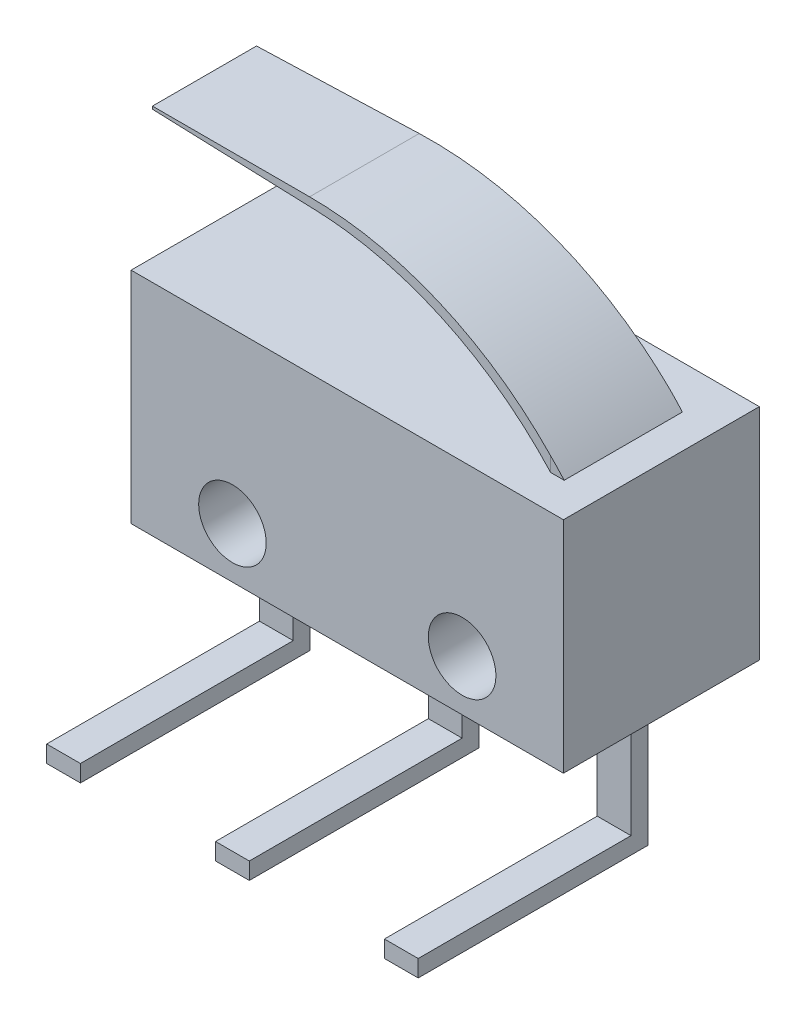
ISO-10303-21;
HEADER;
FILE_DESCRIPTION(('STEP AP214'),'2;1');
FILE_NAME('part.step','',(''),(''),'','','');
FILE_SCHEMA(('AUTOMOTIVE_DESIGN { 1 0 10303 214 1 1 1 1 }'));
ENDSEC;
DATA;
#1=APPLICATION_CONTEXT('core data for automotive mechanical design processes');
#2=APPLICATION_PROTOCOL_DEFINITION('international standard','automotive_design',2000,#1);
#3=PRODUCT_CONTEXT('',#1,'mechanical');
#4=PRODUCT('Part','Part','',(#3));
#5=PRODUCT_RELATED_PRODUCT_CATEGORY('part','',(#4));
#6=PRODUCT_DEFINITION_FORMATION('','',#4);
#7=PRODUCT_DEFINITION_CONTEXT('part definition',#1,'design');
#8=PRODUCT_DEFINITION('design','',#6,#7);
#9=PRODUCT_DEFINITION_SHAPE('','',#8);
#10=(LENGTH_UNIT() NAMED_UNIT(*) SI_UNIT(.MILLI.,.METRE.));
#11=(NAMED_UNIT(*) PLANE_ANGLE_UNIT() SI_UNIT($,.RADIAN.));
#12=(NAMED_UNIT(*) SI_UNIT($,.STERADIAN.) SOLID_ANGLE_UNIT());
#13=UNCERTAINTY_MEASURE_WITH_UNIT(LENGTH_MEASURE(1.E-05),#10,'distance_accuracy_value','');
#14=(GEOMETRIC_REPRESENTATION_CONTEXT(3) GLOBAL_UNCERTAINTY_ASSIGNED_CONTEXT((#13)) GLOBAL_UNIT_ASSIGNED_CONTEXT((#10,
#11,#12)) REPRESENTATION_CONTEXT('',''));
#15=CARTESIAN_POINT('',(0.,0.,0.));
#16=DIRECTION('',(0.,0.,1.));
#17=DIRECTION('',(1.,0.,0.));
#18=AXIS2_PLACEMENT_3D('',#15,#16,#17);
#19=CARTESIAN_POINT('',(0.,6.5,5.8));
#20=DIRECTION('',(0.,-1.,0.));
#21=DIRECTION('',(0.,0.,-1.));
#22=AXIS2_PLACEMENT_3D('',#19,#20,#21);
#23=PLANE('',#22);
#24=DIRECTION('',(-1.,0.,0.));
#25=VECTOR('',#24,1.);
#26=CARTESIAN_POINT('',(0.,6.5,0.));
#27=LINE('',#26,#25);
#28=CARTESIAN_POINT('',(12.8,6.5,0.));
#29=VERTEX_POINT('',#28);
#30=CARTESIAN_POINT('',(0.,6.5,0.));
#31=VERTEX_POINT('',#30);
#32=EDGE_CURVE('E426',#29,#31,#27,.T.);
#33=ORIENTED_EDGE('',*,*,#32,.T.);
#34=DIRECTION('',(0.,0.,-1.));
#35=VECTOR('',#34,1.);
#36=CARTESIAN_POINT('',(0.,6.5,5.8));
#37=LINE('',#36,#35);
#38=CARTESIAN_POINT('',(0.,6.5,5.8));
#39=VERTEX_POINT('',#38);
#40=EDGE_CURVE('E432',#39,#31,#37,.T.);
#41=ORIENTED_EDGE('',*,*,#40,.F.);
#42=DIRECTION('',(-1.,0.,0.));
#43=VECTOR('',#42,1.);
#44=CARTESIAN_POINT('',(0.,6.5,5.8));
#45=LINE('',#44,#43);
#46=CARTESIAN_POINT('',(12.8,6.5,5.8));
#47=VERTEX_POINT('',#46);
#48=EDGE_CURVE('E430',#47,#39,#45,.T.);
#49=ORIENTED_EDGE('',*,*,#48,.F.);
#50=DIRECTION('',(0.,0.,-1.));
#51=VECTOR('',#50,1.);
#52=CARTESIAN_POINT('',(12.8,6.5,5.8));
#53=LINE('',#52,#51);
#54=EDGE_CURVE('E442',#47,#29,#53,.T.);
#55=ORIENTED_EDGE('',*,*,#54,.T.);
#56=EDGE_LOOP('',(#33,#41,#49,#55));
#57=FACE_BOUND('',#56,.T.);
#58=DIRECTION('',(0.,0.,-1.));
#59=VECTOR('',#58,1.);
#60=CARTESIAN_POINT('',(11.8,6.5,1.27790758668561));
#61=LINE('',#60,#59);
#62=CARTESIAN_POINT('',(11.8,6.5,4.77790758668561));
#63=VERTEX_POINT('',#62);
#64=CARTESIAN_POINT('',(11.8,6.5,1.27790758668562));
#65=VERTEX_POINT('',#64);
#66=EDGE_CURVE('E246',#63,#65,#61,.T.);
#67=ORIENTED_EDGE('',*,*,#66,.F.);
#68=DIRECTION('',(1.,0.,0.));
#69=VECTOR('',#68,1.);
#70=CARTESIAN_POINT('',(11.8,6.5,4.77790758668561));
#71=LINE('',#70,#69);
#72=CARTESIAN_POINT('',(11.4,6.5,4.77790758668561));
#73=VERTEX_POINT('',#72);
#74=EDGE_CURVE('E265',#73,#63,#71,.T.);
#75=ORIENTED_EDGE('',*,*,#74,.F.);
#76=DIRECTION('',(0.,0.,1.));
#77=VECTOR('',#76,1.);
#78=CARTESIAN_POINT('',(11.4,6.5,1.27790758668561));
#79=LINE('',#78,#77);
#80=CARTESIAN_POINT('',(11.4,6.5,1.27790758668561));
#81=VERTEX_POINT('',#80);
#82=EDGE_CURVE('E262',#81,#73,#79,.T.);
#83=ORIENTED_EDGE('',*,*,#82,.F.);
#84=DIRECTION('',(-1.,0.,0.));
#85=VECTOR('',#84,1.);
#86=CARTESIAN_POINT('',(11.8,6.5,1.27790758668561));
#87=LINE('',#86,#85);
#88=EDGE_CURVE('E249',#65,#81,#87,.T.);
#89=ORIENTED_EDGE('',*,*,#88,.F.);
#90=EDGE_LOOP('',(#67,#75,#83,#89));
#91=FACE_BOUND('',#90,.T.);
#92=ADVANCED_FACE('F33',(#57,#91),#23,.F.);
#93=CARTESIAN_POINT('',(10.9,-4.,2.9));
#94=DIRECTION('',(0.,0.,-1.));
#95=DIRECTION('',(-1.,0.,0.));
#96=AXIS2_PLACEMENT_3D('',#93,#94,#95);
#97=PLANE('',#96);
#98=DIRECTION('',(-1.,0.,0.));
#99=VECTOR('',#98,1.);
#100=CARTESIAN_POINT('',(10.9,-3.5,2.9));
#101=LINE('',#100,#99);
#102=CARTESIAN_POINT('',(11.9,-3.5,2.9));
#103=VERTEX_POINT('',#102);
#104=CARTESIAN_POINT('',(10.9,-3.5,2.9));
#105=VERTEX_POINT('',#104);
#106=EDGE_CURVE('E283',#103,#105,#101,.T.);
#107=ORIENTED_EDGE('',*,*,#106,.F.);
#108=DIRECTION('',(0.,1.,0.));
#109=VECTOR('',#108,1.);
#110=CARTESIAN_POINT('',(11.9,-4.,2.9));
#111=LINE('',#110,#109);
#112=CARTESIAN_POINT('',(11.9,0.,2.9));
#113=VERTEX_POINT('',#112);
#114=EDGE_CURVE('E355',#103,#113,#111,.T.);
#115=ORIENTED_EDGE('',*,*,#114,.T.);
#116=DIRECTION('',(-1.,0.,0.));
#117=VECTOR('',#116,1.);
#118=CARTESIAN_POINT('',(10.9,0.,2.9));
#119=LINE('',#118,#117);
#120=CARTESIAN_POINT('',(10.9,0.,2.9));
#121=VERTEX_POINT('',#120);
#122=EDGE_CURVE('E339',#113,#121,#119,.T.);
#123=ORIENTED_EDGE('',*,*,#122,.T.);
#124=DIRECTION('',(0.,1.,0.));
#125=VECTOR('',#124,1.);
#126=CARTESIAN_POINT('',(10.9,-4.,2.9));
#127=LINE('',#126,#125);
#128=EDGE_CURVE('E343',#105,#121,#127,.T.);
#129=ORIENTED_EDGE('',*,*,#128,.F.);
#130=EDGE_LOOP('',(#107,#115,#123,#129));
#131=FACE_BOUND('',#130,.T.);
#132=ADVANCED_FACE('F488',(#131),#97,.F.);
#133=CARTESIAN_POINT('',(5.9,-4.,2.9));
#134=DIRECTION('',(0.,0.,-1.));
#135=DIRECTION('',(-1.,0.,0.));
#136=AXIS2_PLACEMENT_3D('',#133,#134,#135);
#137=PLANE('',#136);
#138=DIRECTION('',(-1.,0.,0.));
#139=VECTOR('',#138,1.);
#140=CARTESIAN_POINT('',(5.9,-3.5,2.9));
#141=LINE('',#140,#139);
#142=CARTESIAN_POINT('',(6.9,-3.5,2.9));
#143=VERTEX_POINT('',#142);
#144=CARTESIAN_POINT('',(5.9,-3.5,2.9));
#145=VERTEX_POINT('',#144);
#146=EDGE_CURVE('E300',#143,#145,#141,.T.);
#147=ORIENTED_EDGE('',*,*,#146,.F.);
#148=DIRECTION('',(0.,1.,0.));
#149=VECTOR('',#148,1.);
#150=CARTESIAN_POINT('',(6.9,-4.,2.9));
#151=LINE('',#150,#149);
#152=CARTESIAN_POINT('',(6.9,0.,2.9));
#153=VERTEX_POINT('',#152);
#154=EDGE_CURVE('E384',#143,#153,#151,.T.);
#155=ORIENTED_EDGE('',*,*,#154,.T.);
#156=DIRECTION('',(-1.,0.,0.));
#157=VECTOR('',#156,1.);
#158=CARTESIAN_POINT('',(5.9,0.,2.9));
#159=LINE('',#158,#157);
#160=CARTESIAN_POINT('',(5.9,0.,2.9));
#161=VERTEX_POINT('',#160);
#162=EDGE_CURVE('E368',#153,#161,#159,.T.);
#163=ORIENTED_EDGE('',*,*,#162,.T.);
#164=DIRECTION('',(0.,1.,0.));
#165=VECTOR('',#164,1.);
#166=CARTESIAN_POINT('',(5.9,-4.,2.9));
#167=LINE('',#166,#165);
#168=EDGE_CURVE('E372',#145,#161,#167,.T.);
#169=ORIENTED_EDGE('',*,*,#168,.F.);
#170=EDGE_LOOP('',(#147,#155,#163,#169));
#171=FACE_BOUND('',#170,.T.);
#172=ADVANCED_FACE('F494',(#171),#137,.F.);
#173=CARTESIAN_POINT('',(0.9,-4.,2.9));
#174=DIRECTION('',(0.,0.,-1.));
#175=DIRECTION('',(-1.,0.,0.));
#176=AXIS2_PLACEMENT_3D('',#173,#174,#175);
#177=PLANE('',#176);
#178=DIRECTION('',(-1.,0.,0.));
#179=VECTOR('',#178,1.);
#180=CARTESIAN_POINT('',(0.9,-3.5,2.9));
#181=LINE('',#180,#179);
#182=CARTESIAN_POINT('',(1.9,-3.5,2.9));
#183=VERTEX_POINT('',#182);
#184=CARTESIAN_POINT('',(0.9,-3.5,2.9));
#185=VERTEX_POINT('',#184);
#186=EDGE_CURVE('E317',#183,#185,#181,.T.);
#187=ORIENTED_EDGE('',*,*,#186,.F.);
#188=DIRECTION('',(0.,1.,0.));
#189=VECTOR('',#188,1.);
#190=CARTESIAN_POINT('',(1.9,-4.,2.9));
#191=LINE('',#190,#189);
#192=CARTESIAN_POINT('',(1.9,0.,2.9));
#193=VERTEX_POINT('',#192);
#194=EDGE_CURVE('E413',#183,#193,#191,.T.);
#195=ORIENTED_EDGE('',*,*,#194,.T.);
#196=DIRECTION('',(-1.,0.,0.));
#197=VECTOR('',#196,1.);
#198=CARTESIAN_POINT('',(0.9,0.,2.9));
#199=LINE('',#198,#197);
#200=CARTESIAN_POINT('',(0.9,0.,2.9));
#201=VERTEX_POINT('',#200);
#202=EDGE_CURVE('E397',#193,#201,#199,.T.);
#203=ORIENTED_EDGE('',*,*,#202,.T.);
#204=DIRECTION('',(0.,1.,0.));
#205=VECTOR('',#204,1.);
#206=CARTESIAN_POINT('',(0.9,-4.,2.9));
#207=LINE('',#206,#205);
#208=EDGE_CURVE('E401',#185,#201,#207,.T.);
#209=ORIENTED_EDGE('',*,*,#208,.F.);
#210=EDGE_LOOP('',(#187,#195,#203,#209));
#211=FACE_BOUND('',#210,.T.);
#212=ADVANCED_FACE('F510',(#211),#177,.F.);
#213=CARTESIAN_POINT('',(0.,0.,5.8));
#214=DIRECTION('',(0.,1.,0.));
#215=DIRECTION('',(0.,0.,1.));
#216=AXIS2_PLACEMENT_3D('',#213,#214,#215);
#217=PLANE('',#216);
#218=DIRECTION('',(0.,0.,-1.));
#219=VECTOR('',#218,1.);
#220=CARTESIAN_POINT('',(5.9,0.,2.9));
#221=LINE('',#220,#219);
#222=CARTESIAN_POINT('',(5.9,0.,2.4));
#223=VERTEX_POINT('',#222);
#224=EDGE_CURVE('E363',#161,#223,#221,.T.);
#225=ORIENTED_EDGE('',*,*,#224,.F.);
#226=ORIENTED_EDGE('',*,*,#162,.F.);
#227=DIRECTION('',(0.,0.,1.));
#228=VECTOR('',#227,1.);
#229=CARTESIAN_POINT('',(6.9,0.,2.9));
#230=LINE('',#229,#228);
#231=CARTESIAN_POINT('',(6.9,0.,2.4));
#232=VERTEX_POINT('',#231);
#233=EDGE_CURVE('E378',#232,#153,#230,.T.);
#234=ORIENTED_EDGE('',*,*,#233,.F.);
#235=DIRECTION('',(1.,0.,0.));
#236=VECTOR('',#235,1.);
#237=CARTESIAN_POINT('',(5.9,0.,2.4));
#238=LINE('',#237,#236);
#239=EDGE_CURVE('E375',#223,#232,#238,.T.);
#240=ORIENTED_EDGE('',*,*,#239,.F.);
#241=EDGE_LOOP('',(#225,#226,#234,#240));
#242=FACE_BOUND('',#241,.T.);
#243=DIRECTION('',(1.,0.,0.));
#244=VECTOR('',#243,1.);
#245=CARTESIAN_POINT('',(0.,0.,0.));
#246=LINE('',#245,#244);
#247=CARTESIAN_POINT('',(0.,0.,0.));
#248=VERTEX_POINT('',#247);
#249=CARTESIAN_POINT('',(12.8,0.,0.));
#250=VERTEX_POINT('',#249);
#251=EDGE_CURVE('E435',#248,#250,#246,.T.);
#252=ORIENTED_EDGE('',*,*,#251,.T.);
#253=DIRECTION('',(0.,0.,-1.));
#254=VECTOR('',#253,1.);
#255=CARTESIAN_POINT('',(12.8,0.,5.8));
#256=LINE('',#255,#254);
#257=CARTESIAN_POINT('',(12.8,0.,5.8));
#258=VERTEX_POINT('',#257);
#259=EDGE_CURVE('E445',#258,#250,#256,.T.);
#260=ORIENTED_EDGE('',*,*,#259,.F.);
#261=DIRECTION('',(1.,0.,0.));
#262=VECTOR('',#261,1.);
#263=CARTESIAN_POINT('',(0.,0.,5.8));
#264=LINE('',#263,#262);
#265=CARTESIAN_POINT('',(0.,0.,5.8));
#266=VERTEX_POINT('',#265);
#267=EDGE_CURVE('E425',#266,#258,#264,.T.);
#268=ORIENTED_EDGE('',*,*,#267,.F.);
#269=DIRECTION('',(0.,0.,-1.));
#270=VECTOR('',#269,1.);
#271=CARTESIAN_POINT('',(0.,0.,5.8));
#272=LINE('',#271,#270);
#273=EDGE_CURVE('E448',#266,#248,#272,.T.);
#274=ORIENTED_EDGE('',*,*,#273,.T.);
#275=EDGE_LOOP('',(#252,#260,#268,#274));
#276=FACE_BOUND('',#275,.T.);
#277=DIRECTION('',(0.,0.,-1.));
#278=VECTOR('',#277,1.);
#279=CARTESIAN_POINT('',(0.9,0.,2.9));
#280=LINE('',#279,#278);
#281=CARTESIAN_POINT('',(0.9,0.,2.4));
#282=VERTEX_POINT('',#281);
#283=EDGE_CURVE('E392',#201,#282,#280,.T.);
#284=ORIENTED_EDGE('',*,*,#283,.F.);
#285=ORIENTED_EDGE('',*,*,#202,.F.);
#286=DIRECTION('',(0.,0.,1.));
#287=VECTOR('',#286,1.);
#288=CARTESIAN_POINT('',(1.9,0.,2.9));
#289=LINE('',#288,#287);
#290=CARTESIAN_POINT('',(1.9,0.,2.4));
#291=VERTEX_POINT('',#290);
#292=EDGE_CURVE('E407',#291,#193,#289,.T.);
#293=ORIENTED_EDGE('',*,*,#292,.F.);
#294=DIRECTION('',(1.,0.,0.));
#295=VECTOR('',#294,1.);
#296=CARTESIAN_POINT('',(0.9,0.,2.4));
#297=LINE('',#296,#295);
#298=EDGE_CURVE('E404',#282,#291,#297,.T.);
#299=ORIENTED_EDGE('',*,*,#298,.F.);
#300=EDGE_LOOP('',(#284,#285,#293,#299));
#301=FACE_BOUND('',#300,.T.);
#302=DIRECTION('',(0.,0.,-1.));
#303=VECTOR('',#302,1.);
#304=CARTESIAN_POINT('',(10.9,0.,2.9));
#305=LINE('',#304,#303);
#306=CARTESIAN_POINT('',(10.9,0.,2.4));
#307=VERTEX_POINT('',#306);
#308=EDGE_CURVE('E334',#121,#307,#305,.T.);
#309=ORIENTED_EDGE('',*,*,#308,.F.);
#310=ORIENTED_EDGE('',*,*,#122,.F.);
#311=DIRECTION('',(0.,0.,1.));
#312=VECTOR('',#311,1.);
#313=CARTESIAN_POINT('',(11.9,0.,2.9));
#314=LINE('',#313,#312);
#315=CARTESIAN_POINT('',(11.9,0.,2.4));
#316=VERTEX_POINT('',#315);
#317=EDGE_CURVE('E349',#316,#113,#314,.T.);
#318=ORIENTED_EDGE('',*,*,#317,.F.);
#319=DIRECTION('',(1.,0.,0.));
#320=VECTOR('',#319,1.);
#321=CARTESIAN_POINT('',(10.9,0.,2.4));
#322=LINE('',#321,#320);
#323=EDGE_CURVE('E346',#307,#316,#322,.T.);
#324=ORIENTED_EDGE('',*,*,#323,.F.);
#325=EDGE_LOOP('',(#309,#310,#318,#324));
#326=FACE_BOUND('',#325,.T.);
#327=ADVANCED_FACE('F507',(#242,#276,#301,#326),#217,.F.);
#328=CARTESIAN_POINT('',(0.,0.,5.8));
#329=DIRECTION('',(1.,0.,0.));
#330=DIRECTION('',(0.,0.,-1.));
#331=AXIS2_PLACEMENT_3D('',#328,#329,#330);
#332=PLANE('',#331);
#333=DIRECTION('',(0.,-1.,0.));
#334=VECTOR('',#333,1.);
#335=CARTESIAN_POINT('',(0.,0.,0.));
#336=LINE('',#335,#334);
#337=EDGE_CURVE('E421',#31,#248,#336,.T.);
#338=ORIENTED_EDGE('',*,*,#337,.T.);
#339=ORIENTED_EDGE('',*,*,#273,.F.);
#340=DIRECTION('',(0.,-1.,0.));
#341=VECTOR('',#340,1.);
#342=CARTESIAN_POINT('',(0.,0.,5.8));
#343=LINE('',#342,#341);
#344=EDGE_CURVE('E422',#39,#266,#343,.T.);
#345=ORIENTED_EDGE('',*,*,#344,.F.);
#346=ORIENTED_EDGE('',*,*,#40,.T.);
#347=EDGE_LOOP('',(#338,#339,#345,#346));
#348=FACE_BOUND('',#347,.T.);
#349=ADVANCED_FACE('F505',(#348),#332,.F.);
#350=CARTESIAN_POINT('',(12.8,0.,5.8));
#351=DIRECTION('',(-1.,0.,0.));
#352=DIRECTION('',(0.,0.,1.));
#353=AXIS2_PLACEMENT_3D('',#350,#351,#352);
#354=PLANE('',#353);
#355=DIRECTION('',(0.,1.,0.));
#356=VECTOR('',#355,1.);
#357=CARTESIAN_POINT('',(12.8,0.,0.));
#358=LINE('',#357,#356);
#359=EDGE_CURVE('E437',#250,#29,#358,.T.);
#360=ORIENTED_EDGE('',*,*,#359,.T.);
#361=ORIENTED_EDGE('',*,*,#54,.F.);
#362=DIRECTION('',(0.,1.,0.));
#363=VECTOR('',#362,1.);
#364=CARTESIAN_POINT('',(12.8,0.,5.8));
#365=LINE('',#364,#363);
#366=EDGE_CURVE('E428',#258,#47,#365,.T.);
#367=ORIENTED_EDGE('',*,*,#366,.F.);
#368=ORIENTED_EDGE('',*,*,#259,.T.);
#369=EDGE_LOOP('',(#360,#361,#367,#368));
#370=FACE_BOUND('',#369,.T.);
#371=ADVANCED_FACE('F501',(#370),#354,.F.);
#372=CARTESIAN_POINT('',(0.,0.,5.8));
#373=DIRECTION('',(0.,0.,-1.));
#374=DIRECTION('',(-1.,0.,0.));
#375=AXIS2_PLACEMENT_3D('',#372,#373,#374);
#376=PLANE('',#375);
#377=CARTESIAN_POINT('',(3.,1.5,5.8));
#378=DIRECTION('',(0.,0.,-1.));
#379=DIRECTION('',(-1.,0.,0.));
#380=AXIS2_PLACEMENT_3D('',#377,#378,#379);
#381=CIRCLE('',#380,1.);
#382=CARTESIAN_POINT('',(2.,1.5,5.8));
#383=VERTEX_POINT('',#382);
#384=EDGE_CURVE('E274',#383,#383,#381,.T.);
#385=ORIENTED_EDGE('',*,*,#384,.T.);
#386=EDGE_LOOP('',(#385));
#387=FACE_BOUND('',#386,.T.);
#388=CARTESIAN_POINT('',(9.8,1.5,5.8));
#389=DIRECTION('',(0.,0.,-1.));
#390=DIRECTION('',(-1.,0.,0.));
#391=AXIS2_PLACEMENT_3D('',#388,#389,#390);
#392=CIRCLE('',#391,1.);
#393=CARTESIAN_POINT('',(8.8,1.5,5.8));
#394=VERTEX_POINT('',#393);
#395=EDGE_CURVE('E280',#394,#394,#392,.T.);
#396=ORIENTED_EDGE('',*,*,#395,.T.);
#397=EDGE_LOOP('',(#396));
#398=FACE_BOUND('',#397,.T.);
#399=ORIENTED_EDGE('',*,*,#344,.T.);
#400=ORIENTED_EDGE('',*,*,#267,.T.);
#401=ORIENTED_EDGE('',*,*,#366,.T.);
#402=ORIENTED_EDGE('',*,*,#48,.T.);
#403=EDGE_LOOP('',(#399,#400,#401,#402));
#404=FACE_BOUND('',#403,.T.);
#405=ADVANCED_FACE('F504',(#387,#398,#404),#376,.F.);
#406=CARTESIAN_POINT('',(0.,0.,0.));
#407=DIRECTION('',(0.,0.,-1.));
#408=DIRECTION('',(-1.,0.,0.));
#409=AXIS2_PLACEMENT_3D('',#406,#407,#408);
#410=PLANE('',#409);
#411=CARTESIAN_POINT('',(3.,1.5,0.));
#412=DIRECTION('',(0.,0.,-1.));
#413=DIRECTION('',(1.,0.,0.));
#414=AXIS2_PLACEMENT_3D('',#411,#412,#413);
#415=CIRCLE('',#414,1.);
#416=CARTESIAN_POINT('',(4.,1.5,0.));
#417=VERTEX_POINT('',#416);
#418=EDGE_CURVE('E271',#417,#417,#415,.T.);
#419=ORIENTED_EDGE('',*,*,#418,.F.);
#420=EDGE_LOOP('',(#419));
#421=FACE_BOUND('',#420,.T.);
#422=CARTESIAN_POINT('',(9.8,1.5,0.));
#423=DIRECTION('',(0.,0.,-1.));
#424=DIRECTION('',(-1.,0.,0.));
#425=AXIS2_PLACEMENT_3D('',#422,#423,#424);
#426=CIRCLE('',#425,1.);
#427=CARTESIAN_POINT('',(8.8,1.5,0.));
#428=VERTEX_POINT('',#427);
#429=EDGE_CURVE('E277',#428,#428,#426,.T.);
#430=ORIENTED_EDGE('',*,*,#429,.F.);
#431=EDGE_LOOP('',(#430));
#432=FACE_BOUND('',#431,.T.);
#433=ORIENTED_EDGE('',*,*,#337,.F.);
#434=ORIENTED_EDGE('',*,*,#32,.F.);
#435=ORIENTED_EDGE('',*,*,#359,.F.);
#436=ORIENTED_EDGE('',*,*,#251,.F.);
#437=EDGE_LOOP('',(#433,#434,#435,#436));
#438=FACE_BOUND('',#437,.T.);
#439=ADVANCED_FACE('F499',(#421,#432,#438),#410,.T.);
#440=CARTESIAN_POINT('',(0.9,-4.,2.9));
#441=DIRECTION('',(1.,0.,0.));
#442=DIRECTION('',(0.,0.,-1.));
#443=AXIS2_PLACEMENT_3D('',#440,#441,#442);
#444=PLANE('',#443);
#445=ORIENTED_EDGE('',*,*,#283,.T.);
#446=DIRECTION('',(0.,1.,0.));
#447=VECTOR('',#446,1.);
#448=CARTESIAN_POINT('',(0.9,-4.,2.4));
#449=LINE('',#448,#447);
#450=CARTESIAN_POINT('',(0.9,-4.,2.4));
#451=VERTEX_POINT('',#450);
#452=EDGE_CURVE('E418',#451,#282,#449,.T.);
#453=ORIENTED_EDGE('',*,*,#452,.F.);
#454=DIRECTION('',(0.,0.,-1.));
#455=VECTOR('',#454,1.);
#456=CARTESIAN_POINT('',(0.9,-4.,2.9));
#457=LINE('',#456,#455);
#458=CARTESIAN_POINT('',(0.9,-4.,9.2));
#459=VERTEX_POINT('',#458);
#460=EDGE_CURVE('E393',#459,#451,#457,.T.);
#461=ORIENTED_EDGE('',*,*,#460,.F.);
#462=DIRECTION('',(0.,-1.,0.));
#463=VECTOR('',#462,1.);
#464=CARTESIAN_POINT('',(0.9,-4.,9.2));
#465=LINE('',#464,#463);
#466=CARTESIAN_POINT('',(0.9,-3.5,9.2));
#467=VERTEX_POINT('',#466);
#468=EDGE_CURVE('E318',#467,#459,#465,.T.);
#469=ORIENTED_EDGE('',*,*,#468,.F.);
#470=DIRECTION('',(0.,0.,-1.));
#471=VECTOR('',#470,1.);
#472=CARTESIAN_POINT('',(0.9,-3.5,9.2));
#473=LINE('',#472,#471);
#474=EDGE_CURVE('E328',#467,#185,#473,.T.);
#475=ORIENTED_EDGE('',*,*,#474,.T.);
#476=ORIENTED_EDGE('',*,*,#208,.T.);
#477=EDGE_LOOP('',(#445,#453,#461,#469,#475,#476));
#478=FACE_BOUND('',#477,.T.);
#479=ADVANCED_FACE('F609',(#478),#444,.F.);
#480=CARTESIAN_POINT('',(0.9,-4.,2.4));
#481=DIRECTION('',(0.,0.,1.));
#482=DIRECTION('',(1.,0.,0.));
#483=AXIS2_PLACEMENT_3D('',#480,#481,#482);
#484=PLANE('',#483);
#485=ORIENTED_EDGE('',*,*,#298,.T.);
#486=DIRECTION('',(0.,1.,0.));
#487=VECTOR('',#486,1.);
#488=CARTESIAN_POINT('',(1.9,-4.,2.4));
#489=LINE('',#488,#487);
#490=CARTESIAN_POINT('',(1.9,-4.,2.4));
#491=VERTEX_POINT('',#490);
#492=EDGE_CURVE('E415',#491,#291,#489,.T.);
#493=ORIENTED_EDGE('',*,*,#492,.F.);
#494=DIRECTION('',(1.,0.,0.));
#495=VECTOR('',#494,1.);
#496=CARTESIAN_POINT('',(0.9,-4.,2.4));
#497=LINE('',#496,#495);
#498=EDGE_CURVE('E396',#451,#491,#497,.T.);
#499=ORIENTED_EDGE('',*,*,#498,.F.);
#500=ORIENTED_EDGE('',*,*,#452,.T.);
#501=EDGE_LOOP('',(#485,#493,#499,#500));
#502=FACE_BOUND('',#501,.T.);
#503=ADVANCED_FACE('F768',(#502),#484,.F.);
#504=CARTESIAN_POINT('',(1.9,-4.,2.9));
#505=DIRECTION('',(-1.,0.,0.));
#506=DIRECTION('',(0.,0.,1.));
#507=AXIS2_PLACEMENT_3D('',#504,#505,#506);
#508=PLANE('',#507);
#509=ORIENTED_EDGE('',*,*,#292,.T.);
#510=ORIENTED_EDGE('',*,*,#194,.F.);
#511=DIRECTION('',(0.,0.,-1.));
#512=VECTOR('',#511,1.);
#513=CARTESIAN_POINT('',(1.9,-3.5,9.2));
#514=LINE('',#513,#512);
#515=CARTESIAN_POINT('',(1.9,-3.5,9.2));
#516=VERTEX_POINT('',#515);
#517=EDGE_CURVE('E332',#516,#183,#514,.T.);
#518=ORIENTED_EDGE('',*,*,#517,.F.);
#519=DIRECTION('',(0.,1.,0.));
#520=VECTOR('',#519,1.);
#521=CARTESIAN_POINT('',(1.9,-4.,9.2));
#522=LINE('',#521,#520);
#523=CARTESIAN_POINT('',(1.9,-4.,9.2));
#524=VERTEX_POINT('',#523);
#525=EDGE_CURVE('E324',#524,#516,#522,.T.);
#526=ORIENTED_EDGE('',*,*,#525,.F.);
#527=DIRECTION('',(0.,0.,1.));
#528=VECTOR('',#527,1.);
#529=CARTESIAN_POINT('',(1.9,-4.,2.9));
#530=LINE('',#529,#528);
#531=EDGE_CURVE('E399',#491,#524,#530,.T.);
#532=ORIENTED_EDGE('',*,*,#531,.F.);
#533=ORIENTED_EDGE('',*,*,#492,.T.);
#534=EDGE_LOOP('',(#509,#510,#518,#526,#532,#533));
#535=FACE_BOUND('',#534,.T.);
#536=ADVANCED_FACE('F757',(#535),#508,.F.);
#537=CARTESIAN_POINT('',(0.,-4.,0.));
#538=DIRECTION('',(0.,-1.,0.));
#539=DIRECTION('',(0.,0.,-1.));
#540=AXIS2_PLACEMENT_3D('',#537,#538,#539);
#541=PLANE('',#540);
#542=ORIENTED_EDGE('',*,*,#460,.T.);
#543=ORIENTED_EDGE('',*,*,#498,.T.);
#544=ORIENTED_EDGE('',*,*,#531,.T.);
#545=DIRECTION('',(1.,0.,0.));
#546=VECTOR('',#545,1.);
#547=CARTESIAN_POINT('',(0.9,-4.,9.2));
#548=LINE('',#547,#546);
#549=EDGE_CURVE('E321',#459,#524,#548,.T.);
#550=ORIENTED_EDGE('',*,*,#549,.F.);
#551=EDGE_LOOP('',(#542,#543,#544,#550));
#552=FACE_BOUND('',#551,.T.);
#553=ADVANCED_FACE('F746',(#552),#541,.T.);
#554=CARTESIAN_POINT('',(5.9,-4.,2.9));
#555=DIRECTION('',(1.,0.,0.));
#556=DIRECTION('',(0.,0.,-1.));
#557=AXIS2_PLACEMENT_3D('',#554,#555,#556);
#558=PLANE('',#557);
#559=ORIENTED_EDGE('',*,*,#224,.T.);
#560=DIRECTION('',(0.,1.,0.));
#561=VECTOR('',#560,1.);
#562=CARTESIAN_POINT('',(5.9,-4.,2.4));
#563=LINE('',#562,#561);
#564=CARTESIAN_POINT('',(5.9,-4.,2.4));
#565=VERTEX_POINT('',#564);
#566=EDGE_CURVE('E389',#565,#223,#563,.T.);
#567=ORIENTED_EDGE('',*,*,#566,.F.);
#568=DIRECTION('',(0.,0.,-1.));
#569=VECTOR('',#568,1.);
#570=CARTESIAN_POINT('',(5.9,-4.,2.9));
#571=LINE('',#570,#569);
#572=CARTESIAN_POINT('',(5.9,-4.,9.2));
#573=VERTEX_POINT('',#572);
#574=EDGE_CURVE('E364',#573,#565,#571,.T.);
#575=ORIENTED_EDGE('',*,*,#574,.F.);
#576=DIRECTION('',(0.,-1.,0.));
#577=VECTOR('',#576,1.);
#578=CARTESIAN_POINT('',(5.9,-4.,9.2));
#579=LINE('',#578,#577);
#580=CARTESIAN_POINT('',(5.9,-3.5,9.2));
#581=VERTEX_POINT('',#580);
#582=EDGE_CURVE('E301',#581,#573,#579,.T.);
#583=ORIENTED_EDGE('',*,*,#582,.F.);
#584=DIRECTION('',(0.,0.,-1.));
#585=VECTOR('',#584,1.);
#586=CARTESIAN_POINT('',(5.9,-3.5,9.2));
#587=LINE('',#586,#585);
#588=EDGE_CURVE('E311',#581,#145,#587,.T.);
#589=ORIENTED_EDGE('',*,*,#588,.T.);
#590=ORIENTED_EDGE('',*,*,#168,.T.);
#591=EDGE_LOOP('',(#559,#567,#575,#583,#589,#590));
#592=FACE_BOUND('',#591,.T.);
#593=ADVANCED_FACE('F742',(#592),#558,.F.);
#594=CARTESIAN_POINT('',(5.9,-4.,2.4));
#595=DIRECTION('',(0.,0.,1.));
#596=DIRECTION('',(1.,0.,0.));
#597=AXIS2_PLACEMENT_3D('',#594,#595,#596);
#598=PLANE('',#597);
#599=ORIENTED_EDGE('',*,*,#239,.T.);
#600=DIRECTION('',(0.,1.,0.));
#601=VECTOR('',#600,1.);
#602=CARTESIAN_POINT('',(6.9,-4.,2.4));
#603=LINE('',#602,#601);
#604=CARTESIAN_POINT('',(6.9,-4.,2.4));
#605=VERTEX_POINT('',#604);
#606=EDGE_CURVE('E386',#605,#232,#603,.T.);
#607=ORIENTED_EDGE('',*,*,#606,.F.);
#608=DIRECTION('',(1.,0.,0.));
#609=VECTOR('',#608,1.);
#610=CARTESIAN_POINT('',(5.9,-4.,2.4));
#611=LINE('',#610,#609);
#612=EDGE_CURVE('E367',#565,#605,#611,.T.);
#613=ORIENTED_EDGE('',*,*,#612,.F.);
#614=ORIENTED_EDGE('',*,*,#566,.T.);
#615=EDGE_LOOP('',(#599,#607,#613,#614));
#616=FACE_BOUND('',#615,.T.);
#617=ADVANCED_FACE('F733',(#616),#598,.F.);
#618=CARTESIAN_POINT('',(6.9,-4.,2.9));
#619=DIRECTION('',(-1.,0.,0.));
#620=DIRECTION('',(0.,0.,1.));
#621=AXIS2_PLACEMENT_3D('',#618,#619,#620);
#622=PLANE('',#621);
#623=ORIENTED_EDGE('',*,*,#233,.T.);
#624=ORIENTED_EDGE('',*,*,#154,.F.);
#625=DIRECTION('',(0.,0.,-1.));
#626=VECTOR('',#625,1.);
#627=CARTESIAN_POINT('',(6.9,-3.5,9.2));
#628=LINE('',#627,#626);
#629=CARTESIAN_POINT('',(6.9,-3.5,9.2));
#630=VERTEX_POINT('',#629);
#631=EDGE_CURVE('E315',#630,#143,#628,.T.);
#632=ORIENTED_EDGE('',*,*,#631,.F.);
#633=DIRECTION('',(0.,1.,0.));
#634=VECTOR('',#633,1.);
#635=CARTESIAN_POINT('',(6.9,-4.,9.2));
#636=LINE('',#635,#634);
#637=CARTESIAN_POINT('',(6.9,-4.,9.2));
#638=VERTEX_POINT('',#637);
#639=EDGE_CURVE('E307',#638,#630,#636,.T.);
#640=ORIENTED_EDGE('',*,*,#639,.F.);
#641=DIRECTION('',(0.,0.,1.));
#642=VECTOR('',#641,1.);
#643=CARTESIAN_POINT('',(6.9,-4.,2.9));
#644=LINE('',#643,#642);
#645=EDGE_CURVE('E370',#605,#638,#644,.T.);
#646=ORIENTED_EDGE('',*,*,#645,.F.);
#647=ORIENTED_EDGE('',*,*,#606,.T.);
#648=EDGE_LOOP('',(#623,#624,#632,#640,#646,#647));
#649=FACE_BOUND('',#648,.T.);
#650=ADVANCED_FACE('F722',(#649),#622,.F.);
#651=CARTESIAN_POINT('',(0.,-4.,0.));
#652=DIRECTION('',(0.,-1.,0.));
#653=DIRECTION('',(0.,0.,-1.));
#654=AXIS2_PLACEMENT_3D('',#651,#652,#653);
#655=PLANE('',#654);
#656=ORIENTED_EDGE('',*,*,#574,.T.);
#657=ORIENTED_EDGE('',*,*,#612,.T.);
#658=ORIENTED_EDGE('',*,*,#645,.T.);
#659=DIRECTION('',(1.,0.,0.));
#660=VECTOR('',#659,1.);
#661=CARTESIAN_POINT('',(5.9,-4.,9.2));
#662=LINE('',#661,#660);
#663=EDGE_CURVE('E304',#573,#638,#662,.T.);
#664=ORIENTED_EDGE('',*,*,#663,.F.);
#665=EDGE_LOOP('',(#656,#657,#658,#664));
#666=FACE_BOUND('',#665,.T.);
#667=ADVANCED_FACE('F711',(#666),#655,.T.);
#668=CARTESIAN_POINT('',(10.9,-4.,2.9));
#669=DIRECTION('',(1.,0.,0.));
#670=DIRECTION('',(0.,0.,-1.));
#671=AXIS2_PLACEMENT_3D('',#668,#669,#670);
#672=PLANE('',#671);
#673=ORIENTED_EDGE('',*,*,#308,.T.);
#674=DIRECTION('',(0.,1.,0.));
#675=VECTOR('',#674,1.);
#676=CARTESIAN_POINT('',(10.9,-4.,2.4));
#677=LINE('',#676,#675);
#678=CARTESIAN_POINT('',(10.9,-4.,2.4));
#679=VERTEX_POINT('',#678);
#680=EDGE_CURVE('E360',#679,#307,#677,.T.);
#681=ORIENTED_EDGE('',*,*,#680,.F.);
#682=DIRECTION('',(0.,0.,-1.));
#683=VECTOR('',#682,1.);
#684=CARTESIAN_POINT('',(10.9,-4.,2.9));
#685=LINE('',#684,#683);
#686=CARTESIAN_POINT('',(10.9,-4.,9.2));
#687=VERTEX_POINT('',#686);
#688=EDGE_CURVE('E335',#687,#679,#685,.T.);
#689=ORIENTED_EDGE('',*,*,#688,.F.);
#690=DIRECTION('',(0.,-1.,0.));
#691=VECTOR('',#690,1.);
#692=CARTESIAN_POINT('',(10.9,-4.,9.2));
#693=LINE('',#692,#691);
#694=CARTESIAN_POINT('',(10.9,-3.5,9.2));
#695=VERTEX_POINT('',#694);
#696=EDGE_CURVE('E284',#695,#687,#693,.T.);
#697=ORIENTED_EDGE('',*,*,#696,.F.);
#698=DIRECTION('',(0.,0.,-1.));
#699=VECTOR('',#698,1.);
#700=CARTESIAN_POINT('',(10.9,-3.5,9.2));
#701=LINE('',#700,#699);
#702=EDGE_CURVE('E294',#695,#105,#701,.T.);
#703=ORIENTED_EDGE('',*,*,#702,.T.);
#704=ORIENTED_EDGE('',*,*,#128,.T.);
#705=EDGE_LOOP('',(#673,#681,#689,#697,#703,#704));
#706=FACE_BOUND('',#705,.T.);
#707=ADVANCED_FACE('F707',(#706),#672,.F.);
#708=CARTESIAN_POINT('',(10.9,-4.,2.4));
#709=DIRECTION('',(0.,0.,1.));
#710=DIRECTION('',(1.,0.,0.));
#711=AXIS2_PLACEMENT_3D('',#708,#709,#710);
#712=PLANE('',#711);
#713=ORIENTED_EDGE('',*,*,#323,.T.);
#714=DIRECTION('',(0.,1.,0.));
#715=VECTOR('',#714,1.);
#716=CARTESIAN_POINT('',(11.9,-4.,2.4));
#717=LINE('',#716,#715);
#718=CARTESIAN_POINT('',(11.9,-4.,2.4));
#719=VERTEX_POINT('',#718);
#720=EDGE_CURVE('E357',#719,#316,#717,.T.);
#721=ORIENTED_EDGE('',*,*,#720,.F.);
#722=DIRECTION('',(1.,0.,0.));
#723=VECTOR('',#722,1.);
#724=CARTESIAN_POINT('',(10.9,-4.,2.4));
#725=LINE('',#724,#723);
#726=EDGE_CURVE('E338',#679,#719,#725,.T.);
#727=ORIENTED_EDGE('',*,*,#726,.F.);
#728=ORIENTED_EDGE('',*,*,#680,.T.);
#729=EDGE_LOOP('',(#713,#721,#727,#728));
#730=FACE_BOUND('',#729,.T.);
#731=ADVANCED_FACE('F698',(#730),#712,.F.);
#732=CARTESIAN_POINT('',(11.9,-4.,2.9));
#733=DIRECTION('',(-1.,0.,0.));
#734=DIRECTION('',(0.,0.,1.));
#735=AXIS2_PLACEMENT_3D('',#732,#733,#734);
#736=PLANE('',#735);
#737=ORIENTED_EDGE('',*,*,#317,.T.);
#738=ORIENTED_EDGE('',*,*,#114,.F.);
#739=DIRECTION('',(0.,0.,-1.));
#740=VECTOR('',#739,1.);
#741=CARTESIAN_POINT('',(11.9,-3.5,9.2));
#742=LINE('',#741,#740);
#743=CARTESIAN_POINT('',(11.9,-3.5,9.2));
#744=VERTEX_POINT('',#743);
#745=EDGE_CURVE('E298',#744,#103,#742,.T.);
#746=ORIENTED_EDGE('',*,*,#745,.F.);
#747=DIRECTION('',(0.,1.,0.));
#748=VECTOR('',#747,1.);
#749=CARTESIAN_POINT('',(11.9,-4.,9.2));
#750=LINE('',#749,#748);
#751=CARTESIAN_POINT('',(11.9,-4.,9.2));
#752=VERTEX_POINT('',#751);
#753=EDGE_CURVE('E290',#752,#744,#750,.T.);
#754=ORIENTED_EDGE('',*,*,#753,.F.);
#755=DIRECTION('',(0.,0.,1.));
#756=VECTOR('',#755,1.);
#757=CARTESIAN_POINT('',(11.9,-4.,2.9));
#758=LINE('',#757,#756);
#759=EDGE_CURVE('E341',#719,#752,#758,.T.);
#760=ORIENTED_EDGE('',*,*,#759,.F.);
#761=ORIENTED_EDGE('',*,*,#720,.T.);
#762=EDGE_LOOP('',(#737,#738,#746,#754,#760,#761));
#763=FACE_BOUND('',#762,.T.);
#764=ADVANCED_FACE('F687',(#763),#736,.F.);
#765=CARTESIAN_POINT('',(0.,-4.,0.));
#766=DIRECTION('',(0.,-1.,0.));
#767=DIRECTION('',(0.,0.,-1.));
#768=AXIS2_PLACEMENT_3D('',#765,#766,#767);
#769=PLANE('',#768);
#770=ORIENTED_EDGE('',*,*,#688,.T.);
#771=ORIENTED_EDGE('',*,*,#726,.T.);
#772=ORIENTED_EDGE('',*,*,#759,.T.);
#773=DIRECTION('',(1.,0.,0.));
#774=VECTOR('',#773,1.);
#775=CARTESIAN_POINT('',(10.9,-4.,9.2));
#776=LINE('',#775,#774);
#777=EDGE_CURVE('E287',#687,#752,#776,.T.);
#778=ORIENTED_EDGE('',*,*,#777,.F.);
#779=EDGE_LOOP('',(#770,#771,#772,#778));
#780=FACE_BOUND('',#779,.T.);
#781=ADVANCED_FACE('F677',(#780),#769,.T.);
#782=CARTESIAN_POINT('',(0.9,-3.5,9.2));
#783=DIRECTION('',(0.,-1.,0.));
#784=DIRECTION('',(0.,0.,-1.));
#785=AXIS2_PLACEMENT_3D('',#782,#783,#784);
#786=PLANE('',#785);
#787=ORIENTED_EDGE('',*,*,#186,.T.);
#788=ORIENTED_EDGE('',*,*,#474,.F.);
#789=DIRECTION('',(-1.,0.,0.));
#790=VECTOR('',#789,1.);
#791=CARTESIAN_POINT('',(0.9,-3.5,9.2));
#792=LINE('',#791,#790);
#793=EDGE_CURVE('E326',#516,#467,#792,.T.);
#794=ORIENTED_EDGE('',*,*,#793,.F.);
#795=ORIENTED_EDGE('',*,*,#517,.T.);
#796=EDGE_LOOP('',(#787,#788,#794,#795));
#797=FACE_BOUND('',#796,.T.);
#798=ADVANCED_FACE('F667',(#797),#786,.F.);
#799=CARTESIAN_POINT('',(0.,0.,9.2));
#800=DIRECTION('',(0.,0.,-1.));
#801=DIRECTION('',(-1.,0.,0.));
#802=AXIS2_PLACEMENT_3D('',#799,#800,#801);
#803=PLANE('',#802);
#804=ORIENTED_EDGE('',*,*,#468,.T.);
#805=ORIENTED_EDGE('',*,*,#549,.T.);
#806=ORIENTED_EDGE('',*,*,#525,.T.);
#807=ORIENTED_EDGE('',*,*,#793,.T.);
#808=EDGE_LOOP('',(#804,#805,#806,#807));
#809=FACE_BOUND('',#808,.T.);
#810=ADVANCED_FACE('F657',(#809),#803,.F.);
#811=CARTESIAN_POINT('',(5.9,-3.5,9.2));
#812=DIRECTION('',(0.,-1.,0.));
#813=DIRECTION('',(0.,0.,-1.));
#814=AXIS2_PLACEMENT_3D('',#811,#812,#813);
#815=PLANE('',#814);
#816=ORIENTED_EDGE('',*,*,#146,.T.);
#817=ORIENTED_EDGE('',*,*,#588,.F.);
#818=DIRECTION('',(-1.,0.,0.));
#819=VECTOR('',#818,1.);
#820=CARTESIAN_POINT('',(5.9,-3.5,9.2));
#821=LINE('',#820,#819);
#822=EDGE_CURVE('E309',#630,#581,#821,.T.);
#823=ORIENTED_EDGE('',*,*,#822,.F.);
#824=ORIENTED_EDGE('',*,*,#631,.T.);
#825=EDGE_LOOP('',(#816,#817,#823,#824));
#826=FACE_BOUND('',#825,.T.);
#827=ADVANCED_FACE('F647',(#826),#815,.F.);
#828=CARTESIAN_POINT('',(0.,0.,9.2));
#829=DIRECTION('',(0.,0.,-1.));
#830=DIRECTION('',(-1.,0.,0.));
#831=AXIS2_PLACEMENT_3D('',#828,#829,#830);
#832=PLANE('',#831);
#833=ORIENTED_EDGE('',*,*,#582,.T.);
#834=ORIENTED_EDGE('',*,*,#663,.T.);
#835=ORIENTED_EDGE('',*,*,#639,.T.);
#836=ORIENTED_EDGE('',*,*,#822,.T.);
#837=EDGE_LOOP('',(#833,#834,#835,#836));
#838=FACE_BOUND('',#837,.T.);
#839=ADVANCED_FACE('F637',(#838),#832,.F.);
#840=CARTESIAN_POINT('',(10.9,-3.5,9.2));
#841=DIRECTION('',(0.,-1.,0.));
#842=DIRECTION('',(0.,0.,-1.));
#843=AXIS2_PLACEMENT_3D('',#840,#841,#842);
#844=PLANE('',#843);
#845=ORIENTED_EDGE('',*,*,#106,.T.);
#846=ORIENTED_EDGE('',*,*,#702,.F.);
#847=DIRECTION('',(-1.,0.,0.));
#848=VECTOR('',#847,1.);
#849=CARTESIAN_POINT('',(10.9,-3.5,9.2));
#850=LINE('',#849,#848);
#851=EDGE_CURVE('E292',#744,#695,#850,.T.);
#852=ORIENTED_EDGE('',*,*,#851,.F.);
#853=ORIENTED_EDGE('',*,*,#745,.T.);
#854=EDGE_LOOP('',(#845,#846,#852,#853));
#855=FACE_BOUND('',#854,.T.);
#856=ADVANCED_FACE('F627',(#855),#844,.F.);
#857=CARTESIAN_POINT('',(0.,0.,9.2));
#858=DIRECTION('',(0.,0.,-1.));
#859=DIRECTION('',(-1.,0.,0.));
#860=AXIS2_PLACEMENT_3D('',#857,#858,#859);
#861=PLANE('',#860);
#862=ORIENTED_EDGE('',*,*,#696,.T.);
#863=ORIENTED_EDGE('',*,*,#777,.T.);
#864=ORIENTED_EDGE('',*,*,#753,.T.);
#865=ORIENTED_EDGE('',*,*,#851,.T.);
#866=EDGE_LOOP('',(#862,#863,#864,#865));
#867=FACE_BOUND('',#866,.T.);
#868=ADVANCED_FACE('F597',(#867),#861,.F.);
#869=CARTESIAN_POINT('',(9.8,1.5,6.3));
#870=DIRECTION('',(0.,0.,-1.));
#871=DIRECTION('',(-1.,0.,0.));
#872=AXIS2_PLACEMENT_3D('',#869,#870,#871);
#873=CYLINDRICAL_SURFACE('',#872,1.);
#874=ORIENTED_EDGE('',*,*,#429,.T.);
#875=EDGE_LOOP('',(#874));
#876=FACE_BOUND('',#875,.T.);
#877=ORIENTED_EDGE('',*,*,#395,.F.);
#878=EDGE_LOOP('',(#877));
#879=FACE_BOUND('',#878,.T.);
#880=ADVANCED_FACE('F587',(#876,#879),#873,.F.);
#881=CARTESIAN_POINT('',(3.,1.5,6.3));
#882=DIRECTION('',(0.,0.,-1.));
#883=DIRECTION('',(-1.,0.,0.));
#884=AXIS2_PLACEMENT_3D('',#881,#882,#883);
#885=CYLINDRICAL_SURFACE('',#884,1.);
#886=ORIENTED_EDGE('',*,*,#418,.T.);
#887=EDGE_LOOP('',(#886));
#888=FACE_BOUND('',#887,.T.);
#889=ORIENTED_EDGE('',*,*,#384,.F.);
#890=EDGE_LOOP('',(#889));
#891=FACE_BOUND('',#890,.T.);
#892=ADVANCED_FACE('F559',(#888,#891),#885,.F.);
#893=CARTESIAN_POINT('',(11.8,10.,1.27790758668561));
#894=DIRECTION('',(0.,0.,1.));
#895=DIRECTION('',(1.,0.,0.));
#896=AXIS2_PLACEMENT_3D('',#893,#894,#895);
#897=PLANE('',#896);
#898=DIRECTION('',(0.,-1.,0.));
#899=VECTOR('',#898,1.);
#900=CARTESIAN_POINT('',(11.4,10.,1.27790758668561));
#901=LINE('',#900,#899);
#902=CARTESIAN_POINT('',(11.4,6.92643062748079,1.27790758668561));
#903=VERTEX_POINT('',#902);
#904=EDGE_CURVE('E269',#903,#81,#901,.T.);
#905=ORIENTED_EDGE('',*,*,#904,.F.);
#906=CARTESIAN_POINT('',(4.30963389790783,-0.125286081115931,1.27790758668561));
#907=DIRECTION('',(0.,0.,1.));
#908=DIRECTION('',(1.,0.,0.));
#909=AXIS2_PLACEMENT_3D('',#906,#907,#908);
#910=CIRCLE('',#909,10.);
#911=EDGE_CURVE('E461',#903,#65,#910,.F.);
#912=ORIENTED_EDGE('',*,*,#911,.T.);
#913=ORIENTED_EDGE('',*,*,#88,.T.);
#914=EDGE_LOOP('',(#905,#912,#913));
#915=FACE_BOUND('',#914,.T.);
#916=ADVANCED_FACE('F465',(#915),#897,.F.);
#917=CARTESIAN_POINT('',(11.8,10.,4.77790758668561));
#918=DIRECTION('',(0.,0.,-1.));
#919=DIRECTION('',(-1.,0.,0.));
#920=AXIS2_PLACEMENT_3D('',#917,#918,#919);
#921=PLANE('',#920);
#922=ORIENTED_EDGE('',*,*,#74,.T.);
#923=CARTESIAN_POINT('',(4.30963389790783,-0.125286081115931,4.77790758668561));
#924=DIRECTION('',(0.,0.,-1.));
#925=DIRECTION('',(-1.,0.,0.));
#926=AXIS2_PLACEMENT_3D('',#923,#924,#925);
#927=CIRCLE('',#926,10.);
#928=CARTESIAN_POINT('',(11.4,6.92643062748079,4.77790758668561));
#929=VERTEX_POINT('',#928);
#930=EDGE_CURVE('E41',#63,#929,#927,.F.);
#931=ORIENTED_EDGE('',*,*,#930,.T.);
#932=DIRECTION('',(0.,-1.,0.));
#933=VECTOR('',#932,1.);
#934=CARTESIAN_POINT('',(11.4,10.,4.77790758668561));
#935=LINE('',#934,#933);
#936=EDGE_CURVE('E267',#929,#73,#935,.T.);
#937=ORIENTED_EDGE('',*,*,#936,.T.);
#938=EDGE_LOOP('',(#922,#931,#937));
#939=FACE_BOUND('',#938,.T.);
#940=ADVANCED_FACE('F544',(#939),#921,.F.);
#941=CARTESIAN_POINT('',(11.4,10.,1.27790758668561));
#942=DIRECTION('',(-0.0174524064372835,0.,-0.999847695156391));
#943=DIRECTION('',(-0.999847695156391,0.,0.0174524064372835));
#944=AXIS2_PLACEMENT_3D('',#941,#942,#943);
#945=PLANE('',#944);
#946=DIRECTION('',(0.999695459881887,0.0174497491606827,-0.0174497491606827));
#947=VECTOR('',#946,1.);
#948=CARTESIAN_POINT('',(11.4,10.,1.27790758668561));
#949=LINE('',#948,#947);
#950=CARTESIAN_POINT('',(-0.599999999999998,9.79053922086139,1.48736836582423));
#951=VERTEX_POINT('',#950);
#952=CARTESIAN_POINT('',(4.13510983353499,9.87319087044798,1.40471671623763));
#953=VERTEX_POINT('',#952);
#954=EDGE_CURVE('E254',#951,#953,#949,.T.);
#955=ORIENTED_EDGE('',*,*,#954,.T.);
#956=CARTESIAN_POINT('',(4.30963389790783,-0.125286081115931,1.40167038736247));
#957=DIRECTION('',(-0.0174524064372835,0.,-0.999847695156391));
#958=DIRECTION('',(-0.999847695156391,0.,0.0174524064372835));
#959=AXIS2_PLACEMENT_3D('',#956,#957,#958);
#960=ELLIPSE('',#959,10.0015232804391,10.);
#961=EDGE_CURVE('E55',#953,#903,#960,.T.);
#962=ORIENTED_EDGE('',*,*,#961,.T.);
#963=ORIENTED_EDGE('',*,*,#904,.T.);
#964=CARTESIAN_POINT('',(4.13793225254621,-0.374763416394158,1.40466745073054));
#965=DIRECTION('',(-0.0174524064372835,0.,-0.999847695156391));
#966=DIRECTION('',(0.999847695156391,0.,-0.0174524064372835));
#967=AXIS2_PLACEMENT_3D('',#964,#965,#966);
#968=ELLIPSE('',#967,10.0015232804391,10.);
#969=CARTESIAN_POINT('',(4.31245631691905,9.62371353516976,1.40162112185537));
#970=VERTEX_POINT('',#969);
#971=EDGE_CURVE('E245',#81,#970,#968,.F.);
#972=ORIENTED_EDGE('',*,*,#971,.T.);
#973=DIRECTION('',(0.999695459881887,-0.0174497491606827,-0.0174497491606827));
#974=VECTOR('',#973,1.);
#975=CARTESIAN_POINT('',(11.4,9.5,1.27790758668561));
#976=LINE('',#975,#974);
#977=CARTESIAN_POINT('',(-0.599999999999998,9.70946077913861,1.48736836582423));
#978=VERTEX_POINT('',#977);
#979=EDGE_CURVE('E228',#978,#970,#976,.T.);
#980=ORIENTED_EDGE('',*,*,#979,.F.);
#981=DIRECTION('',(0.,1.,0.));
#982=VECTOR('',#981,1.);
#983=CARTESIAN_POINT('',(-0.599999999999998,10.,1.48736836582423));
#984=LINE('',#983,#982);
#985=EDGE_CURVE('E235',#951,#978,#984,.F.);
#986=ORIENTED_EDGE('',*,*,#985,.F.);
#987=EDGE_LOOP('',(#955,#962,#963,#972,#980,#986));
#988=FACE_BOUND('',#987,.T.);
#989=ADVANCED_FACE('F243',(#988),#945,.T.);
#990=CARTESIAN_POINT('',(11.4,9.5,1.27790758668561));
#991=DIRECTION('',(-0.0174524064372835,-0.999847695156391,0.));
#992=DIRECTION('',(0.999847695156391,-0.0174524064372835,0.));
#993=AXIS2_PLACEMENT_3D('',#990,#991,#992);
#994=PLANE('',#993);
#995=ORIENTED_EDGE('',*,*,#979,.T.);
#996=DIRECTION('',(0.,0.,1.));
#997=VECTOR('',#996,1.);
#998=CARTESIAN_POINT('',(4.31245631691905,9.62371353516976,1.27790758668561));
#999=LINE('',#998,#997);
#1000=CARTESIAN_POINT('',(4.31245631691905,9.62371353516976,4.65419405151586));
#1001=VERTEX_POINT('',#1000);
#1002=EDGE_CURVE('E451',#970,#1001,#999,.T.);
#1003=ORIENTED_EDGE('',*,*,#1002,.T.);
#1004=DIRECTION('',(0.999695459881887,-0.0174497491606827,0.0174497491606827));
#1005=VECTOR('',#1004,1.);
#1006=CARTESIAN_POINT('',(11.391277782494,9.50015224687288,4.77775533981273));
#1007=LINE('',#1006,#1005);
#1008=CARTESIAN_POINT('',(-0.599999999999998,9.70946077913861,4.568446807547));
#1009=VERTEX_POINT('',#1008);
#1010=EDGE_CURVE('E231',#1009,#1001,#1007,.T.);
#1011=ORIENTED_EDGE('',*,*,#1010,.F.);
#1012=DIRECTION('',(0.,0.,-1.));
#1013=VECTOR('',#1012,1.);
#1014=CARTESIAN_POINT('',(-0.599999999999998,9.70946077913861,1.27790758668561));
#1015=LINE('',#1014,#1013);
#1016=EDGE_CURVE('E223',#978,#1009,#1015,.F.);
#1017=ORIENTED_EDGE('',*,*,#1016,.F.);
#1018=EDGE_LOOP('',(#995,#1003,#1011,#1017));
#1019=FACE_BOUND('',#1018,.T.);
#1020=ADVANCED_FACE('F225',(#1019),#994,.T.);
#1021=CARTESIAN_POINT('',(11.4,10.,4.77790758668561));
#1022=DIRECTION('',(-0.0174524064372835,0.,0.999847695156391));
#1023=DIRECTION('',(0.999847695156391,0.,0.0174524064372835));
#1024=AXIS2_PLACEMENT_3D('',#1021,#1022,#1023);
#1025=PLANE('',#1024);
#1026=ORIENTED_EDGE('',*,*,#936,.F.);
#1027=CARTESIAN_POINT('',(4.30963389790783,-0.125286081115931,4.65414478600876));
#1028=DIRECTION('',(-0.0174524064372835,0.,0.999847695156391));
#1029=DIRECTION('',(0.999847695156391,0.,0.0174524064372835));
#1030=AXIS2_PLACEMENT_3D('',#1027,#1028,#1029);
#1031=ELLIPSE('',#1030,10.0015232804391,10.);
#1032=CARTESIAN_POINT('',(4.13510983353499,9.87319087044798,4.6510984571336));
#1033=VERTEX_POINT('',#1032);
#1034=EDGE_CURVE('E11',#929,#1033,#1031,.T.);
#1035=ORIENTED_EDGE('',*,*,#1034,.T.);
#1036=DIRECTION('',(0.999695459881887,0.0174497491606827,0.0174497491606827));
#1037=VECTOR('',#1036,1.);
#1038=CARTESIAN_POINT('',(11.338944477458,9.9989342718898,4.77684185857542));
#1039=LINE('',#1038,#1037);
#1040=CARTESIAN_POINT('',(-0.599999999999998,9.79053922086139,4.568446807547));
#1041=VERTEX_POINT('',#1040);
#1042=EDGE_CURVE('E251',#1041,#1033,#1039,.T.);
#1043=ORIENTED_EDGE('',*,*,#1042,.F.);
#1044=DIRECTION('',(0.,-1.,0.));
#1045=VECTOR('',#1044,1.);
#1046=CARTESIAN_POINT('',(-0.599999999999998,10.,4.568446807547));
#1047=LINE('',#1046,#1045);
#1048=EDGE_CURVE('E234',#1009,#1041,#1047,.F.);
#1049=ORIENTED_EDGE('',*,*,#1048,.F.);
#1050=ORIENTED_EDGE('',*,*,#1010,.T.);
#1051=CARTESIAN_POINT('',(4.13793225254621,-0.374763416394158,4.65114772264069));
#1052=DIRECTION('',(-0.0174524064372835,0.,0.999847695156391));
#1053=DIRECTION('',(-0.999847695156391,0.,-0.0174524064372835));
#1054=AXIS2_PLACEMENT_3D('',#1051,#1052,#1053);
#1055=ELLIPSE('',#1054,10.0015232804391,10.);
#1056=EDGE_CURVE('E453',#1001,#73,#1055,.F.);
#1057=ORIENTED_EDGE('',*,*,#1056,.T.);
#1058=EDGE_LOOP('',(#1026,#1035,#1043,#1049,#1050,#1057));
#1059=FACE_BOUND('',#1058,.T.);
#1060=ADVANCED_FACE('F474',(#1059),#1025,.T.);
#1061=CARTESIAN_POINT('',(11.4,10.,1.27790758668561));
#1062=DIRECTION('',(-0.0174524064372835,0.999847695156391,0.));
#1063=DIRECTION('',(-0.999847695156391,-0.0174524064372835,0.));
#1064=AXIS2_PLACEMENT_3D('',#1061,#1062,#1063);
#1065=PLANE('',#1064);
#1066=ORIENTED_EDGE('',*,*,#1042,.T.);
#1067=DIRECTION('',(0.,0.,-1.));
#1068=VECTOR('',#1067,1.);
#1069=CARTESIAN_POINT('',(4.13510983353499,9.87319087044798,1.27790758668561));
#1070=LINE('',#1069,#1068);
#1071=EDGE_CURVE('E457',#1033,#953,#1070,.T.);
#1072=ORIENTED_EDGE('',*,*,#1071,.T.);
#1073=ORIENTED_EDGE('',*,*,#954,.F.);
#1074=DIRECTION('',(0.,0.,1.));
#1075=VECTOR('',#1074,1.);
#1076=CARTESIAN_POINT('',(-0.599999999999998,9.79053922086139,1.27790758668561));
#1077=LINE('',#1076,#1075);
#1078=EDGE_CURVE('E240',#1041,#951,#1077,.F.);
#1079=ORIENTED_EDGE('',*,*,#1078,.F.);
#1080=EDGE_LOOP('',(#1066,#1072,#1073,#1079));
#1081=FACE_BOUND('',#1080,.T.);
#1082=ADVANCED_FACE('F476',(#1081),#1065,.T.);
#1083=CARTESIAN_POINT('',(-0.599999999999998,0.,0.));
#1084=DIRECTION('',(-1.,0.,0.));
#1085=DIRECTION('',(0.,0.,1.));
#1086=AXIS2_PLACEMENT_3D('',#1083,#1084,#1085);
#1087=PLANE('',#1086);
#1088=ORIENTED_EDGE('',*,*,#985,.T.);
#1089=ORIENTED_EDGE('',*,*,#1016,.T.);
#1090=ORIENTED_EDGE('',*,*,#1048,.T.);
#1091=ORIENTED_EDGE('',*,*,#1078,.T.);
#1092=EDGE_LOOP('',(#1088,#1089,#1090,#1091));
#1093=FACE_BOUND('',#1092,.T.);
#1094=ADVANCED_FACE('F238',(#1093),#1087,.T.);
#1095=CARTESIAN_POINT('',(4.13793225254621,-0.374763416394158,1.27790758668561));
#1096=DIRECTION('',(0.,0.,-1.));
#1097=DIRECTION('',(-1.,0.,0.));
#1098=AXIS2_PLACEMENT_3D('',#1095,#1096,#1097);
#1099=CYLINDRICAL_SURFACE('',#1098,10.);
#1100=ORIENTED_EDGE('',*,*,#971,.F.);
#1101=ORIENTED_EDGE('',*,*,#82,.T.);
#1102=ORIENTED_EDGE('',*,*,#1056,.F.);
#1103=ORIENTED_EDGE('',*,*,#1002,.F.);
#1104=EDGE_LOOP('',(#1100,#1101,#1102,#1103));
#1105=FACE_BOUND('',#1104,.T.);
#1106=ADVANCED_FACE('F483',(#1105),#1099,.F.);
#1107=CARTESIAN_POINT('',(4.30963389790783,-0.125286081115931,1.27790758668561));
#1108=DIRECTION('',(0.,0.,1.));
#1109=DIRECTION('',(1.,0.,0.));
#1110=AXIS2_PLACEMENT_3D('',#1107,#1108,#1109);
#1111=CYLINDRICAL_SURFACE('',#1110,10.);
#1112=ORIENTED_EDGE('',*,*,#930,.F.);
#1113=ORIENTED_EDGE('',*,*,#66,.T.);
#1114=ORIENTED_EDGE('',*,*,#911,.F.);
#1115=ORIENTED_EDGE('',*,*,#961,.F.);
#1116=ORIENTED_EDGE('',*,*,#1071,.F.);
#1117=ORIENTED_EDGE('',*,*,#1034,.F.);
#1118=EDGE_LOOP('',(#1112,#1113,#1114,#1115,#1116,#1117));
#1119=FACE_BOUND('',#1118,.T.);
#1120=ADVANCED_FACE('F35',(#1119),#1111,.T.);
#1121=CLOSED_SHELL('',(#92,#132,#172,#212,#327,#349,#371,#405,#439,#479,#503,#536,#553,#593,
#617,#650,#667,#707,#731,#764,#781,#798,#810,#827,#839,#856,#868,#880,#892,#916,#940,#989,#1020,
#1060,#1082,#1094,#1106,#1120));
#1122=MANIFOLD_SOLID_BREP('B2',#1121);
#1123=ADVANCED_BREP_SHAPE_REPRESENTATION('',(#18,#1122),#14);
#1124=SHAPE_DEFINITION_REPRESENTATION(#9,#1123);
ENDSEC;
END-ISO-10303-21;
